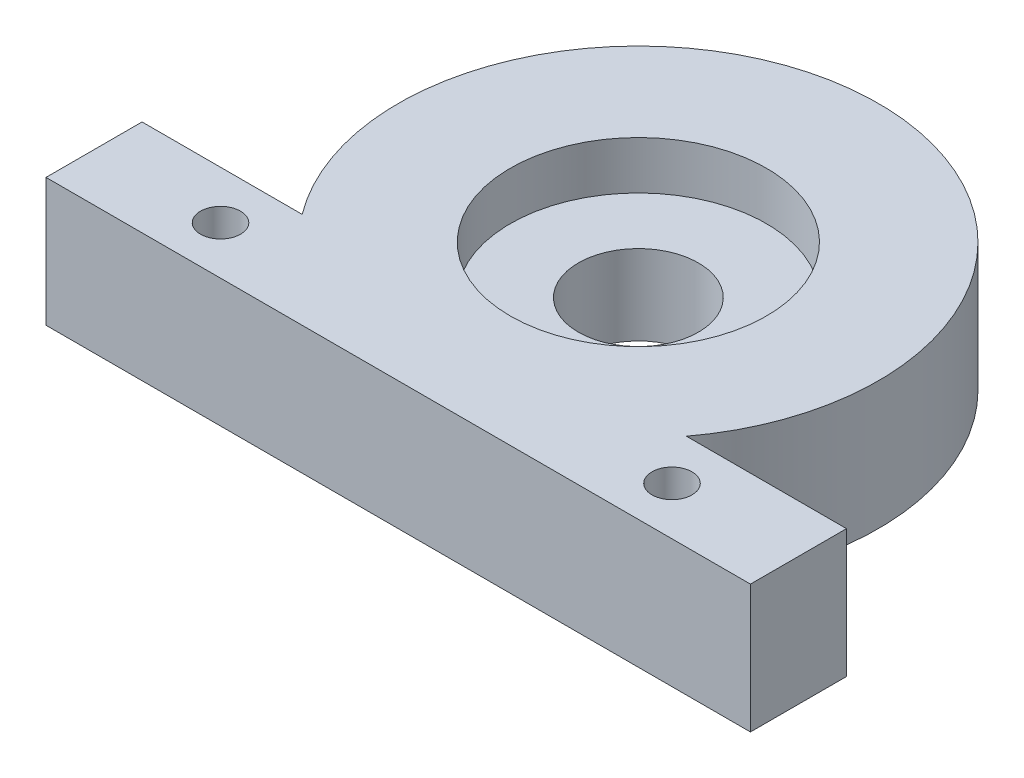
ISO-10303-21;
HEADER;
FILE_DESCRIPTION(('STEP AP214'),'2;1');
FILE_NAME('part.step','',(''),(''),'','','');
FILE_SCHEMA(('AUTOMOTIVE_DESIGN { 1 0 10303 214 1 1 1 1 }'));
ENDSEC;
DATA;
#1=APPLICATION_CONTEXT('core data for automotive mechanical design processes');
#2=APPLICATION_PROTOCOL_DEFINITION('international standard','automotive_design',2000,#1);
#3=PRODUCT_CONTEXT('',#1,'mechanical');
#4=PRODUCT('Part','Part','',(#3));
#5=PRODUCT_RELATED_PRODUCT_CATEGORY('part','',(#4));
#6=PRODUCT_DEFINITION_FORMATION('','',#4);
#7=PRODUCT_DEFINITION_CONTEXT('part definition',#1,'design');
#8=PRODUCT_DEFINITION('design','',#6,#7);
#9=PRODUCT_DEFINITION_SHAPE('','',#8);
#10=(LENGTH_UNIT() NAMED_UNIT(*) SI_UNIT(.MILLI.,.METRE.));
#11=(NAMED_UNIT(*) PLANE_ANGLE_UNIT() SI_UNIT($,.RADIAN.));
#12=(NAMED_UNIT(*) SI_UNIT($,.STERADIAN.) SOLID_ANGLE_UNIT());
#13=UNCERTAINTY_MEASURE_WITH_UNIT(LENGTH_MEASURE(1.E-05),#10,'distance_accuracy_value','');
#14=(GEOMETRIC_REPRESENTATION_CONTEXT(3) GLOBAL_UNCERTAINTY_ASSIGNED_CONTEXT((#13)) GLOBAL_UNIT_ASSIGNED_CONTEXT((#10,
#11,#12)) REPRESENTATION_CONTEXT('',''));
#15=CARTESIAN_POINT('',(0.,0.,0.));
#16=DIRECTION('',(0.,0.,1.));
#17=DIRECTION('',(1.,0.,0.));
#18=AXIS2_PLACEMENT_3D('',#15,#16,#17);
#19=CARTESIAN_POINT('',(0.,4.,0.));
#20=DIRECTION('',(0.,-1.,0.));
#21=DIRECTION('',(0.,0.,-1.));
#22=AXIS2_PLACEMENT_3D('',#19,#20,#21);
#23=CYLINDRICAL_SURFACE('',#22,1.875);
#24=CARTESIAN_POINT('',(0.,0.,0.));
#25=DIRECTION('',(0.,1.,0.));
#26=DIRECTION('',(0.,0.,1.));
#27=AXIS2_PLACEMENT_3D('',#24,#25,#26);
#28=CIRCLE('',#27,1.875);
#29=CARTESIAN_POINT('',(0.,0.,1.875));
#30=VERTEX_POINT('',#29);
#31=EDGE_CURVE('E186',#30,#30,#28,.T.);
#32=ORIENTED_EDGE('',*,*,#31,.F.);
#33=EDGE_LOOP('',(#32));
#34=FACE_BOUND('',#33,.T.);
#35=CARTESIAN_POINT('',(0.,2.5,0.));
#36=DIRECTION('',(0.,1.,0.));
#37=DIRECTION('',(0.,0.,1.));
#38=AXIS2_PLACEMENT_3D('',#35,#36,#37);
#39=CIRCLE('',#38,1.875);
#40=CARTESIAN_POINT('',(0.,2.5,1.875));
#41=VERTEX_POINT('',#40);
#42=EDGE_CURVE('E37',#41,#41,#39,.T.);
#43=ORIENTED_EDGE('',*,*,#42,.T.);
#44=EDGE_LOOP('',(#43));
#45=FACE_BOUND('',#44,.T.);
#46=ADVANCED_FACE('F33',(#34,#45),#23,.F.);
#47=CARTESIAN_POINT('',(0.,4.,0.));
#48=DIRECTION('',(0.,1.,0.));
#49=DIRECTION('',(0.,0.,1.));
#50=AXIS2_PLACEMENT_3D('',#47,#48,#49);
#51=PLANE('',#50);
#52=CARTESIAN_POINT('',(0.,4.,0.));
#53=DIRECTION('',(0.,1.,0.));
#54=DIRECTION('',(0.,0.,1.));
#55=AXIS2_PLACEMENT_3D('',#52,#53,#54);
#56=CIRCLE('',#55,4.);
#57=CARTESIAN_POINT('',(0.,4.,4.));
#58=VERTEX_POINT('',#57);
#59=EDGE_CURVE('E204',#58,#58,#56,.T.);
#60=ORIENTED_EDGE('',*,*,#59,.F.);
#61=EDGE_LOOP('',(#60));
#62=FACE_BOUND('',#61,.T.);
#63=CARTESIAN_POINT('',(7.05,4.,6.));
#64=DIRECTION('',(0.,1.,0.));
#65=DIRECTION('',(0.,0.,1.));
#66=AXIS2_PLACEMENT_3D('',#63,#64,#65);
#67=CIRCLE('',#66,0.625);
#68=CARTESIAN_POINT('',(7.05,4.,6.625));
#69=VERTEX_POINT('',#68);
#70=EDGE_CURVE('E185',#69,#69,#67,.T.);
#71=ORIENTED_EDGE('',*,*,#70,.F.);
#72=EDGE_LOOP('',(#71));
#73=FACE_BOUND('',#72,.T.);
#74=CARTESIAN_POINT('',(0.,4.,0.));
#75=DIRECTION('',(0.,1.,0.));
#76=DIRECTION('',(0.,0.,1.));
#77=AXIS2_PLACEMENT_3D('',#74,#75,#76);
#78=CIRCLE('',#77,7.5);
#79=CARTESIAN_POINT('',(6.,4.,4.5));
#80=VERTEX_POINT('',#79);
#81=CARTESIAN_POINT('',(-6.,4.,4.5));
#82=VERTEX_POINT('',#81);
#83=EDGE_CURVE('E131',#80,#82,#78,.T.);
#84=ORIENTED_EDGE('',*,*,#83,.T.);
#85=DIRECTION('',(-1.,0.,0.));
#86=VECTOR('',#85,1.);
#87=CARTESIAN_POINT('',(-6.,4.,4.5));
#88=LINE('',#87,#86);
#89=CARTESIAN_POINT('',(-11.,4.,4.5));
#90=VERTEX_POINT('',#89);
#91=EDGE_CURVE('E88',#82,#90,#88,.T.);
#92=ORIENTED_EDGE('',*,*,#91,.T.);
#93=DIRECTION('',(0.,0.,1.));
#94=VECTOR('',#93,1.);
#95=CARTESIAN_POINT('',(-11.,4.,7.5));
#96=LINE('',#95,#94);
#97=CARTESIAN_POINT('',(-11.,4.,7.5));
#98=VERTEX_POINT('',#97);
#99=EDGE_CURVE('E102',#90,#98,#96,.T.);
#100=ORIENTED_EDGE('',*,*,#99,.T.);
#101=DIRECTION('',(1.,0.,0.));
#102=VECTOR('',#101,1.);
#103=CARTESIAN_POINT('',(11.,4.,7.5));
#104=LINE('',#103,#102);
#105=CARTESIAN_POINT('',(11.,4.,7.5));
#106=VERTEX_POINT('',#105);
#107=EDGE_CURVE('E95',#98,#106,#104,.T.);
#108=ORIENTED_EDGE('',*,*,#107,.T.);
#109=DIRECTION('',(0.,0.,-1.));
#110=VECTOR('',#109,1.);
#111=CARTESIAN_POINT('',(11.,4.,7.5));
#112=LINE('',#111,#110);
#113=CARTESIAN_POINT('',(11.,4.,4.5));
#114=VERTEX_POINT('',#113);
#115=EDGE_CURVE('E100',#106,#114,#112,.T.);
#116=ORIENTED_EDGE('',*,*,#115,.T.);
#117=DIRECTION('',(-1.,0.,0.));
#118=VECTOR('',#117,1.);
#119=CARTESIAN_POINT('',(11.,4.,4.5));
#120=LINE('',#119,#118);
#121=EDGE_CURVE('E51',#114,#80,#120,.T.);
#122=ORIENTED_EDGE('',*,*,#121,.T.);
#123=EDGE_LOOP('',(#84,#92,#100,#108,#116,#122));
#124=FACE_BOUND('',#123,.T.);
#125=CARTESIAN_POINT('',(-7.05,4.,6.));
#126=DIRECTION('',(0.,1.,0.));
#127=DIRECTION('',(0.,0.,1.));
#128=AXIS2_PLACEMENT_3D('',#125,#126,#127);
#129=CIRCLE('',#128,0.625);
#130=CARTESIAN_POINT('',(-7.05,4.,6.625));
#131=VERTEX_POINT('',#130);
#132=EDGE_CURVE('E124',#131,#131,#129,.T.);
#133=ORIENTED_EDGE('',*,*,#132,.F.);
#134=EDGE_LOOP('',(#133));
#135=FACE_BOUND('',#134,.T.);
#136=ADVANCED_FACE('F97',(#62,#73,#124,#135),#51,.T.);
#137=CARTESIAN_POINT('',(0.,0.,0.));
#138=DIRECTION('',(0.,1.,0.));
#139=DIRECTION('',(0.,0.,1.));
#140=AXIS2_PLACEMENT_3D('',#137,#138,#139);
#141=PLANE('',#140);
#142=CARTESIAN_POINT('',(7.05,0.,6.));
#143=DIRECTION('',(0.,1.,0.));
#144=DIRECTION('',(0.,0.,1.));
#145=AXIS2_PLACEMENT_3D('',#142,#143,#144);
#146=CIRCLE('',#145,0.625);
#147=CARTESIAN_POINT('',(7.05,0.,6.625));
#148=VERTEX_POINT('',#147);
#149=EDGE_CURVE('E183',#148,#148,#146,.T.);
#150=ORIENTED_EDGE('',*,*,#149,.T.);
#151=EDGE_LOOP('',(#150));
#152=FACE_BOUND('',#151,.T.);
#153=CARTESIAN_POINT('',(0.,0.,0.));
#154=DIRECTION('',(0.,1.,0.));
#155=DIRECTION('',(0.,0.,1.));
#156=AXIS2_PLACEMENT_3D('',#153,#154,#155);
#157=CIRCLE('',#156,7.5);
#158=CARTESIAN_POINT('',(6.,0.,4.5));
#159=VERTEX_POINT('',#158);
#160=CARTESIAN_POINT('',(-6.,0.,4.5));
#161=VERTEX_POINT('',#160);
#162=EDGE_CURVE('E120',#159,#161,#157,.T.);
#163=ORIENTED_EDGE('',*,*,#162,.F.);
#164=DIRECTION('',(-1.,0.,0.));
#165=VECTOR('',#164,1.);
#166=CARTESIAN_POINT('',(11.,0.,4.5));
#167=LINE('',#166,#165);
#168=CARTESIAN_POINT('',(11.,0.,4.5));
#169=VERTEX_POINT('',#168);
#170=EDGE_CURVE('E80',#169,#159,#167,.T.);
#171=ORIENTED_EDGE('',*,*,#170,.F.);
#172=DIRECTION('',(0.,0.,-1.));
#173=VECTOR('',#172,1.);
#174=CARTESIAN_POINT('',(11.,0.,7.5));
#175=LINE('',#174,#173);
#176=CARTESIAN_POINT('',(11.,0.,7.5));
#177=VERTEX_POINT('',#176);
#178=EDGE_CURVE('E74',#177,#169,#175,.T.);
#179=ORIENTED_EDGE('',*,*,#178,.F.);
#180=DIRECTION('',(1.,0.,0.));
#181=VECTOR('',#180,1.);
#182=CARTESIAN_POINT('',(11.,0.,7.5));
#183=LINE('',#182,#181);
#184=CARTESIAN_POINT('',(-11.,0.,7.5));
#185=VERTEX_POINT('',#184);
#186=EDGE_CURVE('E110',#185,#177,#183,.T.);
#187=ORIENTED_EDGE('',*,*,#186,.F.);
#188=DIRECTION('',(0.,0.,1.));
#189=VECTOR('',#188,1.);
#190=CARTESIAN_POINT('',(-11.,0.,7.5));
#191=LINE('',#190,#189);
#192=CARTESIAN_POINT('',(-11.,0.,4.5));
#193=VERTEX_POINT('',#192);
#194=EDGE_CURVE('E126',#193,#185,#191,.T.);
#195=ORIENTED_EDGE('',*,*,#194,.F.);
#196=DIRECTION('',(-1.,0.,0.));
#197=VECTOR('',#196,1.);
#198=CARTESIAN_POINT('',(-6.,0.,4.5));
#199=LINE('',#198,#197);
#200=EDGE_CURVE('E123',#161,#193,#199,.T.);
#201=ORIENTED_EDGE('',*,*,#200,.F.);
#202=EDGE_LOOP('',(#163,#171,#179,#187,#195,#201));
#203=FACE_BOUND('',#202,.T.);
#204=CARTESIAN_POINT('',(-7.05,0.,6.));
#205=DIRECTION('',(0.,1.,0.));
#206=DIRECTION('',(0.,0.,1.));
#207=AXIS2_PLACEMENT_3D('',#204,#205,#206);
#208=CIRCLE('',#207,0.625);
#209=CARTESIAN_POINT('',(-7.05,0.,6.625));
#210=VERTEX_POINT('',#209);
#211=EDGE_CURVE('E189',#210,#210,#208,.T.);
#212=ORIENTED_EDGE('',*,*,#211,.T.);
#213=EDGE_LOOP('',(#212));
#214=FACE_BOUND('',#213,.T.);
#215=ORIENTED_EDGE('',*,*,#31,.T.);
#216=EDGE_LOOP('',(#215));
#217=FACE_BOUND('',#216,.T.);
#218=ADVANCED_FACE('F141',(#152,#203,#214,#217),#141,.F.);
#219=CARTESIAN_POINT('',(0.,4.,0.));
#220=DIRECTION('',(0.,-1.,0.));
#221=DIRECTION('',(0.,0.,-1.));
#222=AXIS2_PLACEMENT_3D('',#219,#220,#221);
#223=CYLINDRICAL_SURFACE('',#222,7.5);
#224=ORIENTED_EDGE('',*,*,#162,.T.);
#225=DIRECTION('',(0.,-1.,0.));
#226=VECTOR('',#225,1.);
#227=CARTESIAN_POINT('',(-6.,4.,4.5));
#228=LINE('',#227,#226);
#229=EDGE_CURVE('E11',#82,#161,#228,.T.);
#230=ORIENTED_EDGE('',*,*,#229,.F.);
#231=ORIENTED_EDGE('',*,*,#83,.F.);
#232=DIRECTION('',(0.,-1.,0.));
#233=VECTOR('',#232,1.);
#234=CARTESIAN_POINT('',(6.,4.,4.5));
#235=LINE('',#234,#233);
#236=EDGE_CURVE('E116',#80,#159,#235,.T.);
#237=ORIENTED_EDGE('',*,*,#236,.T.);
#238=EDGE_LOOP('',(#224,#230,#231,#237));
#239=FACE_BOUND('',#238,.T.);
#240=ADVANCED_FACE('F35',(#239),#223,.T.);
#241=CARTESIAN_POINT('',(-6.,4.,4.5));
#242=DIRECTION('',(0.,0.,1.));
#243=DIRECTION('',(1.,0.,0.));
#244=AXIS2_PLACEMENT_3D('',#241,#242,#243);
#245=PLANE('',#244);
#246=ORIENTED_EDGE('',*,*,#200,.T.);
#247=DIRECTION('',(0.,-1.,0.));
#248=VECTOR('',#247,1.);
#249=CARTESIAN_POINT('',(-11.,4.,4.5));
#250=LINE('',#249,#248);
#251=EDGE_CURVE('E43',#90,#193,#250,.T.);
#252=ORIENTED_EDGE('',*,*,#251,.F.);
#253=ORIENTED_EDGE('',*,*,#91,.F.);
#254=ORIENTED_EDGE('',*,*,#229,.T.);
#255=EDGE_LOOP('',(#246,#252,#253,#254));
#256=FACE_BOUND('',#255,.T.);
#257=ADVANCED_FACE('F180',(#256),#245,.F.);
#258=CARTESIAN_POINT('',(-11.,4.,7.5));
#259=DIRECTION('',(1.,0.,0.));
#260=DIRECTION('',(0.,0.,-1.));
#261=AXIS2_PLACEMENT_3D('',#258,#259,#260);
#262=PLANE('',#261);
#263=ORIENTED_EDGE('',*,*,#194,.T.);
#264=DIRECTION('',(0.,-1.,0.));
#265=VECTOR('',#264,1.);
#266=CARTESIAN_POINT('',(-11.,4.,7.5));
#267=LINE('',#266,#265);
#268=EDGE_CURVE('E111',#98,#185,#267,.T.);
#269=ORIENTED_EDGE('',*,*,#268,.F.);
#270=ORIENTED_EDGE('',*,*,#99,.F.);
#271=ORIENTED_EDGE('',*,*,#251,.T.);
#272=EDGE_LOOP('',(#263,#269,#270,#271));
#273=FACE_BOUND('',#272,.T.);
#274=ADVANCED_FACE('F138',(#273),#262,.F.);
#275=CARTESIAN_POINT('',(11.,4.,7.5));
#276=DIRECTION('',(0.,0.,-1.));
#277=DIRECTION('',(-1.,0.,0.));
#278=AXIS2_PLACEMENT_3D('',#275,#276,#277);
#279=PLANE('',#278);
#280=ORIENTED_EDGE('',*,*,#186,.T.);
#281=DIRECTION('',(0.,-1.,0.));
#282=VECTOR('',#281,1.);
#283=CARTESIAN_POINT('',(11.,4.,7.5));
#284=LINE('',#283,#282);
#285=EDGE_CURVE('E107',#106,#177,#284,.T.);
#286=ORIENTED_EDGE('',*,*,#285,.F.);
#287=ORIENTED_EDGE('',*,*,#107,.F.);
#288=ORIENTED_EDGE('',*,*,#268,.T.);
#289=EDGE_LOOP('',(#280,#286,#287,#288));
#290=FACE_BOUND('',#289,.T.);
#291=ADVANCED_FACE('F108',(#290),#279,.F.);
#292=CARTESIAN_POINT('',(11.,4.,7.5));
#293=DIRECTION('',(-1.,0.,0.));
#294=DIRECTION('',(0.,0.,1.));
#295=AXIS2_PLACEMENT_3D('',#292,#293,#294);
#296=PLANE('',#295);
#297=ORIENTED_EDGE('',*,*,#178,.T.);
#298=DIRECTION('',(0.,-1.,0.));
#299=VECTOR('',#298,1.);
#300=CARTESIAN_POINT('',(11.,4.,4.5));
#301=LINE('',#300,#299);
#302=EDGE_CURVE('E112',#114,#169,#301,.T.);
#303=ORIENTED_EDGE('',*,*,#302,.F.);
#304=ORIENTED_EDGE('',*,*,#115,.F.);
#305=ORIENTED_EDGE('',*,*,#285,.T.);
#306=EDGE_LOOP('',(#297,#303,#304,#305));
#307=FACE_BOUND('',#306,.T.);
#308=ADVANCED_FACE('F114',(#307),#296,.F.);
#309=CARTESIAN_POINT('',(11.,4.,4.5));
#310=DIRECTION('',(0.,0.,1.));
#311=DIRECTION('',(1.,0.,0.));
#312=AXIS2_PLACEMENT_3D('',#309,#310,#311);
#313=PLANE('',#312);
#314=ORIENTED_EDGE('',*,*,#170,.T.);
#315=ORIENTED_EDGE('',*,*,#236,.F.);
#316=ORIENTED_EDGE('',*,*,#121,.F.);
#317=ORIENTED_EDGE('',*,*,#302,.T.);
#318=EDGE_LOOP('',(#314,#315,#316,#317));
#319=FACE_BOUND('',#318,.T.);
#320=ADVANCED_FACE('F146',(#319),#313,.F.);
#321=CARTESIAN_POINT('',(-7.05,4.,6.));
#322=DIRECTION('',(0.,-1.,0.));
#323=DIRECTION('',(0.,0.,-1.));
#324=AXIS2_PLACEMENT_3D('',#321,#322,#323);
#325=CYLINDRICAL_SURFACE('',#324,0.625);
#326=ORIENTED_EDGE('',*,*,#132,.T.);
#327=EDGE_LOOP('',(#326));
#328=FACE_BOUND('',#327,.T.);
#329=ORIENTED_EDGE('',*,*,#211,.F.);
#330=EDGE_LOOP('',(#329));
#331=FACE_BOUND('',#330,.T.);
#332=ADVANCED_FACE('F148',(#328,#331),#325,.F.);
#333=CARTESIAN_POINT('',(7.05,4.,6.));
#334=DIRECTION('',(0.,-1.,0.));
#335=DIRECTION('',(0.,0.,-1.));
#336=AXIS2_PLACEMENT_3D('',#333,#334,#335);
#337=CYLINDRICAL_SURFACE('',#336,0.625);
#338=ORIENTED_EDGE('',*,*,#70,.T.);
#339=EDGE_LOOP('',(#338));
#340=FACE_BOUND('',#339,.T.);
#341=ORIENTED_EDGE('',*,*,#149,.F.);
#342=EDGE_LOOP('',(#341));
#343=FACE_BOUND('',#342,.T.);
#344=ADVANCED_FACE('F154',(#340,#343),#337,.F.);
#345=CARTESIAN_POINT('',(0.,2.5,0.));
#346=DIRECTION('',(0.,1.,0.));
#347=DIRECTION('',(0.,0.,1.));
#348=AXIS2_PLACEMENT_3D('',#345,#346,#347);
#349=CYLINDRICAL_SURFACE('',#348,4.);
#350=CARTESIAN_POINT('',(0.,2.5,0.));
#351=DIRECTION('',(0.,1.,0.));
#352=DIRECTION('',(0.,0.,1.));
#353=AXIS2_PLACEMENT_3D('',#350,#351,#352);
#354=CIRCLE('',#353,4.);
#355=CARTESIAN_POINT('',(0.,2.5,4.));
#356=VERTEX_POINT('',#355);
#357=EDGE_CURVE('E207',#356,#356,#354,.T.);
#358=ORIENTED_EDGE('',*,*,#357,.F.);
#359=EDGE_LOOP('',(#358));
#360=FACE_BOUND('',#359,.T.);
#361=ORIENTED_EDGE('',*,*,#59,.T.);
#362=EDGE_LOOP('',(#361));
#363=FACE_BOUND('',#362,.T.);
#364=ADVANCED_FACE('F171',(#360,#363),#349,.F.);
#365=CARTESIAN_POINT('',(0.,2.5,0.));
#366=DIRECTION('',(0.,1.,0.));
#367=DIRECTION('',(0.,0.,1.));
#368=AXIS2_PLACEMENT_3D('',#365,#366,#367);
#369=PLANE('',#368);
#370=ORIENTED_EDGE('',*,*,#42,.F.);
#371=EDGE_LOOP('',(#370));
#372=FACE_BOUND('',#371,.T.);
#373=ORIENTED_EDGE('',*,*,#357,.T.);
#374=EDGE_LOOP('',(#373));
#375=FACE_BOUND('',#374,.T.);
#376=ADVANCED_FACE('F214',(#372,#375),#369,.T.);
#377=CLOSED_SHELL('',(#46,#136,#218,#240,#257,#274,#291,#308,#320,#332,#344,#364,#376));
#378=MANIFOLD_SOLID_BREP('B2',#377);
#379=ADVANCED_BREP_SHAPE_REPRESENTATION('',(#18,#378),#14);
#380=SHAPE_DEFINITION_REPRESENTATION(#9,#379);
ENDSEC;
END-ISO-10303-21;
